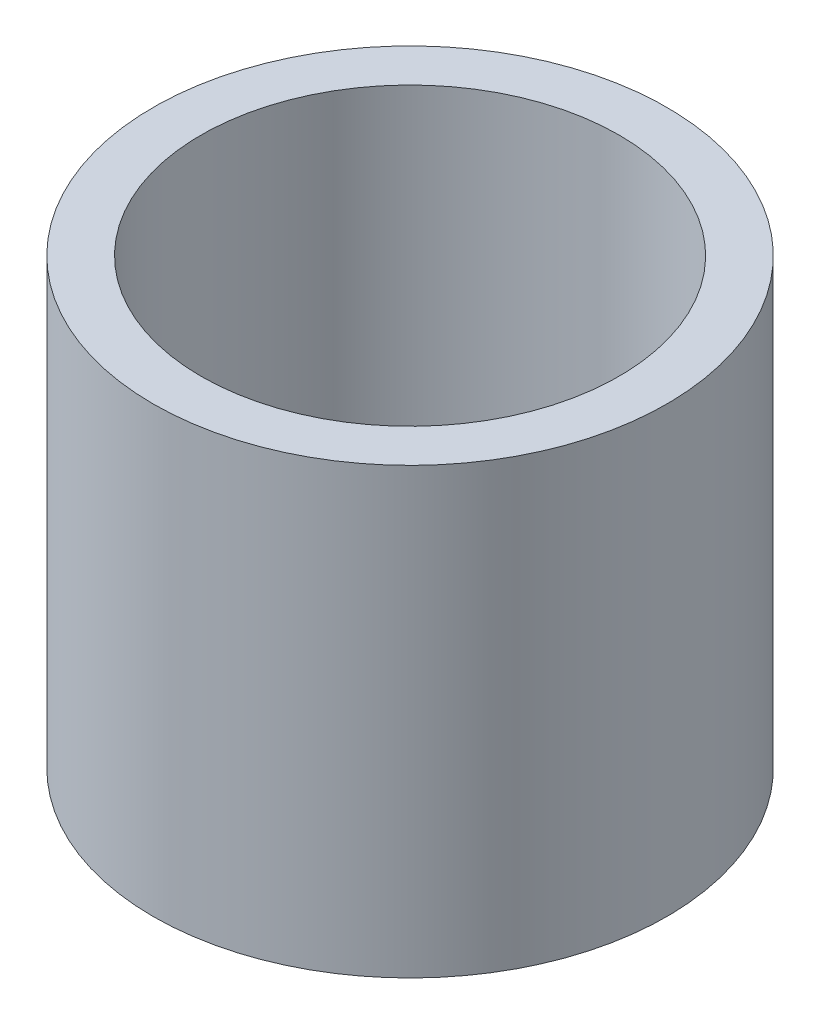
ISO-10303-21;
HEADER;
FILE_DESCRIPTION(('STEP AP214'),'2;1');
FILE_NAME('part.step','',(''),(''),'','','');
FILE_SCHEMA(('AUTOMOTIVE_DESIGN { 1 0 10303 214 1 1 1 1 }'));
ENDSEC;
DATA;
#1=APPLICATION_CONTEXT('core data for automotive mechanical design processes');
#2=APPLICATION_PROTOCOL_DEFINITION('international standard','automotive_design',2000,#1);
#3=PRODUCT_CONTEXT('',#1,'mechanical');
#4=PRODUCT('Part','Part','',(#3));
#5=PRODUCT_RELATED_PRODUCT_CATEGORY('part','',(#4));
#6=PRODUCT_DEFINITION_FORMATION('','',#4);
#7=PRODUCT_DEFINITION_CONTEXT('part definition',#1,'design');
#8=PRODUCT_DEFINITION('design','',#6,#7);
#9=PRODUCT_DEFINITION_SHAPE('','',#8);
#10=(LENGTH_UNIT() NAMED_UNIT(*) SI_UNIT(.MILLI.,.METRE.));
#11=(NAMED_UNIT(*) PLANE_ANGLE_UNIT() SI_UNIT($,.RADIAN.));
#12=(NAMED_UNIT(*) SI_UNIT($,.STERADIAN.) SOLID_ANGLE_UNIT());
#13=UNCERTAINTY_MEASURE_WITH_UNIT(LENGTH_MEASURE(1.E-05),#10,'distance_accuracy_value','');
#14=(GEOMETRIC_REPRESENTATION_CONTEXT(3) GLOBAL_UNCERTAINTY_ASSIGNED_CONTEXT((#13)) GLOBAL_UNIT_ASSIGNED_CONTEXT((#10,
#11,#12)) REPRESENTATION_CONTEXT('',''));
#15=CARTESIAN_POINT('',(0.,0.,0.));
#16=DIRECTION('',(0.,0.,1.));
#17=DIRECTION('',(1.,0.,0.));
#18=AXIS2_PLACEMENT_3D('',#15,#16,#17);
#19=CARTESIAN_POINT('',(0.,34.5652149374116,0.));
#20=DIRECTION('',(0.,-1.,0.));
#21=DIRECTION('',(0.,0.,-1.));
#22=AXIS2_PLACEMENT_3D('',#19,#20,#21);
#23=CYLINDRICAL_SURFACE('',#22,20.);
#24=CARTESIAN_POINT('',(0.,34.5652149374116,0.));
#25=DIRECTION('',(0.,1.,0.));
#26=DIRECTION('',(0.,0.,1.));
#27=AXIS2_PLACEMENT_3D('',#24,#25,#26);
#28=CIRCLE('',#27,20.);
#29=CARTESIAN_POINT('',(0.,34.5652149374116,20.));
#30=VERTEX_POINT('',#29);
#31=EDGE_CURVE('E10',#30,#30,#28,.T.);
#32=ORIENTED_EDGE('',*,*,#31,.F.);
#33=EDGE_LOOP('',(#32));
#34=FACE_BOUND('',#33,.T.);
#35=CARTESIAN_POINT('',(0.,0.,0.));
#36=DIRECTION('',(0.,1.,0.));
#37=DIRECTION('',(0.,0.,1.));
#38=AXIS2_PLACEMENT_3D('',#35,#36,#37);
#39=CIRCLE('',#38,20.);
#40=CARTESIAN_POINT('',(0.,0.,20.));
#41=VERTEX_POINT('',#40);
#42=EDGE_CURVE('E37',#41,#41,#39,.T.);
#43=ORIENTED_EDGE('',*,*,#42,.T.);
#44=EDGE_LOOP('',(#43));
#45=FACE_BOUND('',#44,.T.);
#46=ADVANCED_FACE('F40',(#34,#45),#23,.T.);
#47=CARTESIAN_POINT('',(0.,34.5652149374116,0.));
#48=DIRECTION('',(0.,1.,0.));
#49=DIRECTION('',(0.,0.,1.));
#50=AXIS2_PLACEMENT_3D('',#47,#48,#49);
#51=PLANE('',#50);
#52=CARTESIAN_POINT('',(0.,34.5652149374116,0.));
#53=DIRECTION('',(0.,1.,0.));
#54=DIRECTION('',(0.,0.,1.));
#55=AXIS2_PLACEMENT_3D('',#52,#53,#54);
#56=CIRCLE('',#55,16.2732104818502);
#57=CARTESIAN_POINT('',(0.,34.5652149374116,16.2732104818502));
#58=VERTEX_POINT('',#57);
#59=EDGE_CURVE('E50',#58,#58,#56,.T.);
#60=ORIENTED_EDGE('',*,*,#59,.F.);
#61=EDGE_LOOP('',(#60));
#62=FACE_BOUND('',#61,.T.);
#63=ORIENTED_EDGE('',*,*,#31,.T.);
#64=EDGE_LOOP('',(#63));
#65=FACE_BOUND('',#64,.T.);
#66=ADVANCED_FACE('F59',(#62,#65),#51,.T.);
#67=CARTESIAN_POINT('',(0.,0.,0.));
#68=DIRECTION('',(0.,1.,0.));
#69=DIRECTION('',(0.,0.,1.));
#70=AXIS2_PLACEMENT_3D('',#67,#68,#69);
#71=PLANE('',#70);
#72=CARTESIAN_POINT('',(0.,0.,0.));
#73=DIRECTION('',(0.,1.,0.));
#74=DIRECTION('',(0.,0.,1.));
#75=AXIS2_PLACEMENT_3D('',#72,#73,#74);
#76=CIRCLE('',#75,16.2732104818502);
#77=CARTESIAN_POINT('',(0.,0.,16.2732104818502));
#78=VERTEX_POINT('',#77);
#79=EDGE_CURVE('E47',#78,#78,#76,.T.);
#80=ORIENTED_EDGE('',*,*,#79,.T.);
#81=EDGE_LOOP('',(#80));
#82=FACE_BOUND('',#81,.T.);
#83=ORIENTED_EDGE('',*,*,#42,.F.);
#84=EDGE_LOOP('',(#83));
#85=FACE_BOUND('',#84,.T.);
#86=ADVANCED_FACE('F58',(#82,#85),#71,.F.);
#87=CARTESIAN_POINT('',(0.,34.5652149374116,0.));
#88=DIRECTION('',(0.,-1.,0.));
#89=DIRECTION('',(0.,0.,-1.));
#90=AXIS2_PLACEMENT_3D('',#87,#88,#89);
#91=CYLINDRICAL_SURFACE('',#90,16.2732104818502);
#92=ORIENTED_EDGE('',*,*,#59,.T.);
#93=EDGE_LOOP('',(#92));
#94=FACE_BOUND('',#93,.T.);
#95=ORIENTED_EDGE('',*,*,#79,.F.);
#96=EDGE_LOOP('',(#95));
#97=FACE_BOUND('',#96,.T.);
#98=ADVANCED_FACE('F54',(#94,#97),#91,.F.);
#99=CLOSED_SHELL('',(#46,#66,#86,#98));
#100=MANIFOLD_SOLID_BREP('B2',#99);
#101=ADVANCED_BREP_SHAPE_REPRESENTATION('',(#18,#100),#14);
#102=SHAPE_DEFINITION_REPRESENTATION(#9,#101);
ENDSEC;
END-ISO-10303-21;
